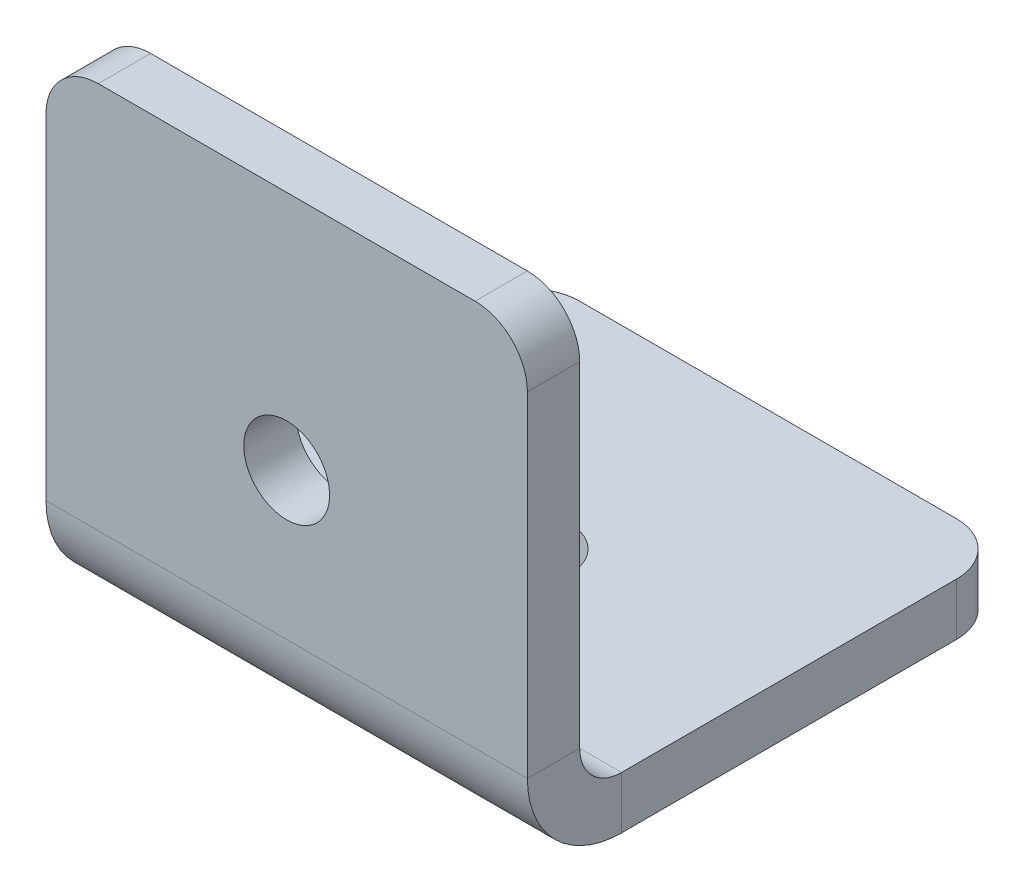
ISO-10303-21;
HEADER;
FILE_DESCRIPTION(('STEP AP214'),'2;1');
FILE_NAME('part.step','',(''),(''),'','','');
FILE_SCHEMA(('AUTOMOTIVE_DESIGN { 1 0 10303 214 1 1 1 1 }'));
ENDSEC;
DATA;
#1=APPLICATION_CONTEXT('core data for automotive mechanical design processes');
#2=APPLICATION_PROTOCOL_DEFINITION('international standard','automotive_design',2000,#1);
#3=PRODUCT_CONTEXT('',#1,'mechanical');
#4=PRODUCT('Part','Part','',(#3));
#5=PRODUCT_RELATED_PRODUCT_CATEGORY('part','',(#4));
#6=PRODUCT_DEFINITION_FORMATION('','',#4);
#7=PRODUCT_DEFINITION_CONTEXT('part definition',#1,'design');
#8=PRODUCT_DEFINITION('design','',#6,#7);
#9=PRODUCT_DEFINITION_SHAPE('','',#8);
#10=(LENGTH_UNIT() NAMED_UNIT(*) SI_UNIT(.MILLI.,.METRE.));
#11=(NAMED_UNIT(*) PLANE_ANGLE_UNIT() SI_UNIT($,.RADIAN.));
#12=(NAMED_UNIT(*) SI_UNIT($,.STERADIAN.) SOLID_ANGLE_UNIT());
#13=UNCERTAINTY_MEASURE_WITH_UNIT(LENGTH_MEASURE(1.E-05),#10,'distance_accuracy_value','');
#14=(GEOMETRIC_REPRESENTATION_CONTEXT(3) GLOBAL_UNCERTAINTY_ASSIGNED_CONTEXT((#13)) GLOBAL_UNIT_ASSIGNED_CONTEXT((#10,
#11,#12)) REPRESENTATION_CONTEXT('',''));
#15=CARTESIAN_POINT('',(0.,0.,0.));
#16=DIRECTION('',(0.,0.,1.));
#17=DIRECTION('',(1.,0.,0.));
#18=AXIS2_PLACEMENT_3D('',#15,#16,#17);
#19=CARTESIAN_POINT('',(23.,9.,0.));
#20=DIRECTION('',(1.,0.,0.));
#21=DIRECTION('',(0.,0.,-1.));
#22=AXIS2_PLACEMENT_3D('',#19,#20,#21);
#23=PLANE('',#22);
#24=DIRECTION('',(0.,0.,-1.));
#25=VECTOR('',#24,1.);
#26=CARTESIAN_POINT('',(23.,9.,0.));
#27=LINE('',#26,#25);
#28=CARTESIAN_POINT('',(23.,9.,0.));
#29=VERTEX_POINT('',#28);
#30=CARTESIAN_POINT('',(23.,9.,-5.));
#31=VERTEX_POINT('',#30);
#32=EDGE_CURVE('E115',#29,#31,#27,.T.);
#33=ORIENTED_EDGE('',*,*,#32,.F.);
#34=CARTESIAN_POINT('',(23.,9.,-9.));
#35=DIRECTION('',(-1.,0.,0.));
#36=DIRECTION('',(0.,0.,1.));
#37=AXIS2_PLACEMENT_3D('',#34,#35,#36);
#38=CIRCLE('',#37,9.);
#39=CARTESIAN_POINT('',(23.,0.,-9.));
#40=VERTEX_POINT('',#39);
#41=EDGE_CURVE('E113',#29,#40,#38,.F.);
#42=ORIENTED_EDGE('',*,*,#41,.T.);
#43=DIRECTION('',(0.,-1.,0.));
#44=VECTOR('',#43,1.);
#45=CARTESIAN_POINT('',(23.,5.,-9.));
#46=LINE('',#45,#44);
#47=CARTESIAN_POINT('',(23.,5.,-9.));
#48=VERTEX_POINT('',#47);
#49=EDGE_CURVE('E107',#48,#40,#46,.T.);
#50=ORIENTED_EDGE('',*,*,#49,.F.);
#51=CARTESIAN_POINT('',(23.,9.,-9.));
#52=DIRECTION('',(1.,0.,0.));
#53=DIRECTION('',(0.,0.,-1.));
#54=AXIS2_PLACEMENT_3D('',#51,#52,#53);
#55=CIRCLE('',#54,4.);
#56=EDGE_CURVE('E111',#31,#48,#55,.T.);
#57=ORIENTED_EDGE('',*,*,#56,.F.);
#58=EDGE_LOOP('',(#33,#42,#50,#57));
#59=FACE_BOUND('',#58,.T.);
#60=ADVANCED_FACE('F16',(#59),#23,.T.);
#61=CARTESIAN_POINT('',(23.,5.,-9.));
#62=DIRECTION('',(1.,0.,0.));
#63=DIRECTION('',(0.,0.,-1.));
#64=AXIS2_PLACEMENT_3D('',#61,#62,#63);
#65=PLANE('',#64);
#66=DIRECTION('',(0.,1.,0.));
#67=VECTOR('',#66,1.);
#68=CARTESIAN_POINT('',(23.,0.,-5.));
#69=LINE('',#68,#67);
#70=CARTESIAN_POINT('',(23.,41.,-5.));
#71=VERTEX_POINT('',#70);
#72=EDGE_CURVE('E139',#71,#31,#69,.F.);
#73=ORIENTED_EDGE('',*,*,#72,.F.);
#74=DIRECTION('',(0.,0.,-1.));
#75=VECTOR('',#74,1.);
#76=CARTESIAN_POINT('',(23.,41.,-9.));
#77=LINE('',#76,#75);
#78=CARTESIAN_POINT('',(23.,41.,0.));
#79=VERTEX_POINT('',#78);
#80=EDGE_CURVE('E192',#71,#79,#77,.F.);
#81=ORIENTED_EDGE('',*,*,#80,.T.);
#82=DIRECTION('',(0.,-1.,0.));
#83=VECTOR('',#82,1.);
#84=CARTESIAN_POINT('',(23.,0.,0.));
#85=LINE('',#84,#83);
#86=EDGE_CURVE('E141',#79,#29,#85,.T.);
#87=ORIENTED_EDGE('',*,*,#86,.T.);
#88=ORIENTED_EDGE('',*,*,#32,.T.);
#89=EDGE_LOOP('',(#73,#81,#87,#88));
#90=FACE_BOUND('',#89,.T.);
#91=ADVANCED_FACE('F254',(#90),#65,.T.);
#92=CARTESIAN_POINT('',(-23.,0.,-9.));
#93=DIRECTION('',(-1.,0.,0.));
#94=DIRECTION('',(0.,0.,1.));
#95=AXIS2_PLACEMENT_3D('',#92,#93,#94);
#96=PLANE('',#95);
#97=DIRECTION('',(0.,1.,0.));
#98=VECTOR('',#97,1.);
#99=CARTESIAN_POINT('',(-23.,0.,-9.));
#100=LINE('',#99,#98);
#101=CARTESIAN_POINT('',(-23.,0.,-9.));
#102=VERTEX_POINT('',#101);
#103=CARTESIAN_POINT('',(-23.,5.,-9.));
#104=VERTEX_POINT('',#103);
#105=EDGE_CURVE('E116',#102,#104,#100,.T.);
#106=ORIENTED_EDGE('',*,*,#105,.F.);
#107=CARTESIAN_POINT('',(-23.,9.,-9.));
#108=DIRECTION('',(-1.,0.,0.));
#109=DIRECTION('',(0.,0.,1.));
#110=AXIS2_PLACEMENT_3D('',#107,#108,#109);
#111=CIRCLE('',#110,9.);
#112=CARTESIAN_POINT('',(-23.,9.,0.));
#113=VERTEX_POINT('',#112);
#114=EDGE_CURVE('E159',#113,#102,#111,.F.);
#115=ORIENTED_EDGE('',*,*,#114,.F.);
#116=DIRECTION('',(0.,0.,1.));
#117=VECTOR('',#116,1.);
#118=CARTESIAN_POINT('',(-23.,9.,-5.));
#119=LINE('',#118,#117);
#120=CARTESIAN_POINT('',(-23.,9.,-5.));
#121=VERTEX_POINT('',#120);
#122=EDGE_CURVE('E177',#121,#113,#119,.T.);
#123=ORIENTED_EDGE('',*,*,#122,.F.);
#124=CARTESIAN_POINT('',(-23.,9.,-9.));
#125=DIRECTION('',(1.,0.,0.));
#126=DIRECTION('',(0.,0.,-1.));
#127=AXIS2_PLACEMENT_3D('',#124,#125,#126);
#128=CIRCLE('',#127,4.);
#129=EDGE_CURVE('E153',#121,#104,#128,.T.);
#130=ORIENTED_EDGE('',*,*,#129,.T.);
#131=EDGE_LOOP('',(#106,#115,#123,#130));
#132=FACE_BOUND('',#131,.T.);
#133=ADVANCED_FACE('F259',(#132),#96,.T.);
#134=CARTESIAN_POINT('',(-23.,9.,-5.));
#135=DIRECTION('',(-1.,0.,0.));
#136=DIRECTION('',(0.,0.,1.));
#137=AXIS2_PLACEMENT_3D('',#134,#135,#136);
#138=PLANE('',#137);
#139=DIRECTION('',(0.,0.,-1.));
#140=VECTOR('',#139,1.);
#141=CARTESIAN_POINT('',(-23.,5.,0.));
#142=LINE('',#141,#140);
#143=CARTESIAN_POINT('',(-23.,5.,-41.));
#144=VERTEX_POINT('',#143);
#145=EDGE_CURVE('E126',#104,#144,#142,.T.);
#146=ORIENTED_EDGE('',*,*,#145,.T.);
#147=DIRECTION('',(0.,-1.,0.));
#148=VECTOR('',#147,1.);
#149=CARTESIAN_POINT('',(-23.,9.,-41.));
#150=LINE('',#149,#148);
#151=CARTESIAN_POINT('',(-23.,0.,-41.));
#152=VERTEX_POINT('',#151);
#153=EDGE_CURVE('E201',#144,#152,#150,.T.);
#154=ORIENTED_EDGE('',*,*,#153,.T.);
#155=DIRECTION('',(0.,0.,-1.));
#156=VECTOR('',#155,1.);
#157=CARTESIAN_POINT('',(-23.,0.,0.));
#158=LINE('',#157,#156);
#159=EDGE_CURVE('E148',#102,#152,#158,.T.);
#160=ORIENTED_EDGE('',*,*,#159,.F.);
#161=ORIENTED_EDGE('',*,*,#105,.T.);
#162=EDGE_LOOP('',(#146,#154,#160,#161));
#163=FACE_BOUND('',#162,.T.);
#164=ADVANCED_FACE('F217',(#163),#138,.T.);
#165=CARTESIAN_POINT('',(23.,0.,0.));
#166=DIRECTION('',(0.,1.,0.));
#167=DIRECTION('',(0.,0.,1.));
#168=AXIS2_PLACEMENT_3D('',#165,#166,#167);
#169=PLANE('',#168);
#170=CARTESIAN_POINT('',(0.,0.,-23.));
#171=DIRECTION('',(0.,1.,0.));
#172=DIRECTION('',(0.,0.,1.));
#173=AXIS2_PLACEMENT_3D('',#170,#171,#172);
#174=CIRCLE('',#173,4.1);
#175=CARTESIAN_POINT('',(0.,0.,-18.9));
#176=VERTEX_POINT('',#175);
#177=EDGE_CURVE('E231',#176,#176,#174,.T.);
#178=ORIENTED_EDGE('',*,*,#177,.T.);
#179=EDGE_LOOP('',(#178));
#180=FACE_BOUND('',#179,.T.);
#181=ORIENTED_EDGE('',*,*,#159,.T.);
#182=CARTESIAN_POINT('',(-18.,0.,-41.));
#183=DIRECTION('',(0.,1.,0.));
#184=DIRECTION('',(0.,0.,1.));
#185=AXIS2_PLACEMENT_3D('',#182,#183,#184);
#186=CIRCLE('',#185,5.);
#187=CARTESIAN_POINT('',(-18.,0.,-46.));
#188=VERTEX_POINT('',#187);
#189=EDGE_CURVE('E206',#152,#188,#186,.F.);
#190=ORIENTED_EDGE('',*,*,#189,.T.);
#191=DIRECTION('',(-1.,0.,0.));
#192=VECTOR('',#191,1.);
#193=CARTESIAN_POINT('',(23.,0.,-46.));
#194=LINE('',#193,#192);
#195=CARTESIAN_POINT('',(18.,0.,-46.));
#196=VERTEX_POINT('',#195);
#197=EDGE_CURVE('E175',#196,#188,#194,.T.);
#198=ORIENTED_EDGE('',*,*,#197,.F.);
#199=CARTESIAN_POINT('',(18.,0.,-41.));
#200=DIRECTION('',(0.,1.,0.));
#201=DIRECTION('',(0.,0.,1.));
#202=AXIS2_PLACEMENT_3D('',#199,#200,#201);
#203=CIRCLE('',#202,5.);
#204=CARTESIAN_POINT('',(23.,0.,-41.));
#205=VERTEX_POINT('',#204);
#206=EDGE_CURVE('E204',#196,#205,#203,.F.);
#207=ORIENTED_EDGE('',*,*,#206,.T.);
#208=DIRECTION('',(0.,0.,-1.));
#209=VECTOR('',#208,1.);
#210=CARTESIAN_POINT('',(23.,0.,0.));
#211=LINE('',#210,#209);
#212=EDGE_CURVE('E134',#40,#205,#211,.T.);
#213=ORIENTED_EDGE('',*,*,#212,.F.);
#214=DIRECTION('',(-1.,0.,0.));
#215=VECTOR('',#214,1.);
#216=CARTESIAN_POINT('',(23.,0.,-9.));
#217=LINE('',#216,#215);
#218=EDGE_CURVE('E147',#40,#102,#217,.T.);
#219=ORIENTED_EDGE('',*,*,#218,.T.);
#220=EDGE_LOOP('',(#181,#190,#198,#207,#213,#219));
#221=FACE_BOUND('',#220,.T.);
#222=ADVANCED_FACE('F222',(#180,#221),#169,.F.);
#223=CARTESIAN_POINT('',(23.,5.,-46.));
#224=DIRECTION('',(0.,0.,-1.));
#225=DIRECTION('',(-1.,0.,0.));
#226=AXIS2_PLACEMENT_3D('',#223,#224,#225);
#227=PLANE('',#226);
#228=ORIENTED_EDGE('',*,*,#197,.T.);
#229=DIRECTION('',(0.,-1.,0.));
#230=VECTOR('',#229,1.);
#231=CARTESIAN_POINT('',(-18.,5.,-46.));
#232=LINE('',#231,#230);
#233=CARTESIAN_POINT('',(-18.,5.,-46.));
#234=VERTEX_POINT('',#233);
#235=EDGE_CURVE('E37',#188,#234,#232,.F.);
#236=ORIENTED_EDGE('',*,*,#235,.T.);
#237=DIRECTION('',(-1.,0.,0.));
#238=VECTOR('',#237,1.);
#239=CARTESIAN_POINT('',(23.,5.,-46.));
#240=LINE('',#239,#238);
#241=CARTESIAN_POINT('',(18.,5.,-46.));
#242=VERTEX_POINT('',#241);
#243=EDGE_CURVE('E130',#242,#234,#240,.T.);
#244=ORIENTED_EDGE('',*,*,#243,.F.);
#245=DIRECTION('',(0.,-1.,0.));
#246=VECTOR('',#245,1.);
#247=CARTESIAN_POINT('',(18.,5.,-46.));
#248=LINE('',#247,#246);
#249=EDGE_CURVE('E208',#242,#196,#248,.T.);
#250=ORIENTED_EDGE('',*,*,#249,.T.);
#251=EDGE_LOOP('',(#228,#236,#244,#250));
#252=FACE_BOUND('',#251,.T.);
#253=ADVANCED_FACE('F223',(#252),#227,.T.);
#254=CARTESIAN_POINT('',(23.,5.,0.));
#255=DIRECTION('',(0.,1.,0.));
#256=DIRECTION('',(0.,0.,1.));
#257=AXIS2_PLACEMENT_3D('',#254,#255,#256);
#258=PLANE('',#257);
#259=CARTESIAN_POINT('',(0.,5.,-23.));
#260=DIRECTION('',(0.,1.,0.));
#261=DIRECTION('',(0.,0.,1.));
#262=AXIS2_PLACEMENT_3D('',#259,#260,#261);
#263=CIRCLE('',#262,4.1);
#264=CARTESIAN_POINT('',(0.,5.,-18.9));
#265=VERTEX_POINT('',#264);
#266=EDGE_CURVE('E236',#265,#265,#263,.T.);
#267=ORIENTED_EDGE('',*,*,#266,.F.);
#268=EDGE_LOOP('',(#267));
#269=FACE_BOUND('',#268,.T.);
#270=ORIENTED_EDGE('',*,*,#243,.T.);
#271=CARTESIAN_POINT('',(-18.,5.,-41.));
#272=DIRECTION('',(0.,1.,0.));
#273=DIRECTION('',(0.,0.,1.));
#274=AXIS2_PLACEMENT_3D('',#271,#272,#273);
#275=CIRCLE('',#274,5.);
#276=EDGE_CURVE('E24',#234,#144,#275,.T.);
#277=ORIENTED_EDGE('',*,*,#276,.T.);
#278=ORIENTED_EDGE('',*,*,#145,.F.);
#279=DIRECTION('',(-1.,0.,0.));
#280=VECTOR('',#279,1.);
#281=CARTESIAN_POINT('',(23.,5.,-9.));
#282=LINE('',#281,#280);
#283=EDGE_CURVE('E121',#48,#104,#282,.T.);
#284=ORIENTED_EDGE('',*,*,#283,.F.);
#285=DIRECTION('',(0.,0.,-1.));
#286=VECTOR('',#285,1.);
#287=CARTESIAN_POINT('',(23.,5.,0.));
#288=LINE('',#287,#286);
#289=CARTESIAN_POINT('',(23.,5.,-41.));
#290=VERTEX_POINT('',#289);
#291=EDGE_CURVE('E123',#48,#290,#288,.T.);
#292=ORIENTED_EDGE('',*,*,#291,.T.);
#293=CARTESIAN_POINT('',(18.,5.,-41.));
#294=DIRECTION('',(0.,1.,0.));
#295=DIRECTION('',(0.,0.,1.));
#296=AXIS2_PLACEMENT_3D('',#293,#294,#295);
#297=CIRCLE('',#296,5.);
#298=EDGE_CURVE('E212',#290,#242,#297,.T.);
#299=ORIENTED_EDGE('',*,*,#298,.T.);
#300=EDGE_LOOP('',(#270,#277,#278,#284,#292,#299));
#301=FACE_BOUND('',#300,.T.);
#302=ADVANCED_FACE('F122',(#269,#301),#258,.T.);
#303=CARTESIAN_POINT('',(23.,9.,-9.));
#304=DIRECTION('',(-1.,0.,0.));
#305=DIRECTION('',(0.,0.,1.));
#306=AXIS2_PLACEMENT_3D('',#303,#304,#305);
#307=CYLINDRICAL_SURFACE('',#306,4.);
#308=ORIENTED_EDGE('',*,*,#129,.F.);
#309=DIRECTION('',(-1.,0.,0.));
#310=VECTOR('',#309,1.);
#311=CARTESIAN_POINT('',(23.,9.,-5.));
#312=LINE('',#311,#310);
#313=EDGE_CURVE('E131',#31,#121,#312,.T.);
#314=ORIENTED_EDGE('',*,*,#313,.F.);
#315=ORIENTED_EDGE('',*,*,#56,.T.);
#316=ORIENTED_EDGE('',*,*,#283,.T.);
#317=EDGE_LOOP('',(#308,#314,#315,#316));
#318=FACE_BOUND('',#317,.T.);
#319=ADVANCED_FACE('F137',(#318),#307,.F.);
#320=CARTESIAN_POINT('',(23.,0.,-5.));
#321=DIRECTION('',(0.,0.,-1.));
#322=DIRECTION('',(-1.,0.,0.));
#323=AXIS2_PLACEMENT_3D('',#320,#321,#322);
#324=PLANE('',#323);
#325=CARTESIAN_POINT('',(0.,23.,-5.));
#326=DIRECTION('',(0.,0.,-1.));
#327=DIRECTION('',(-1.,0.,0.));
#328=AXIS2_PLACEMENT_3D('',#325,#326,#327);
#329=CIRCLE('',#328,4.1);
#330=CARTESIAN_POINT('',(-4.1,23.,-5.));
#331=VERTEX_POINT('',#330);
#332=EDGE_CURVE('E228',#331,#331,#329,.T.);
#333=ORIENTED_EDGE('',*,*,#332,.F.);
#334=EDGE_LOOP('',(#333));
#335=FACE_BOUND('',#334,.T.);
#336=DIRECTION('',(-1.,0.,0.));
#337=VECTOR('',#336,1.);
#338=CARTESIAN_POINT('',(23.,46.,-5.));
#339=LINE('',#338,#337);
#340=CARTESIAN_POINT('',(18.,46.,-5.));
#341=VERTEX_POINT('',#340);
#342=CARTESIAN_POINT('',(-18.,46.,-5.));
#343=VERTEX_POINT('',#342);
#344=EDGE_CURVE('E170',#341,#343,#339,.T.);
#345=ORIENTED_EDGE('',*,*,#344,.F.);
#346=CARTESIAN_POINT('',(18.,41.,-5.));
#347=DIRECTION('',(0.,0.,-1.));
#348=DIRECTION('',(-1.,0.,0.));
#349=AXIS2_PLACEMENT_3D('',#346,#347,#348);
#350=CIRCLE('',#349,5.);
#351=EDGE_CURVE('E190',#341,#71,#350,.T.);
#352=ORIENTED_EDGE('',*,*,#351,.T.);
#353=ORIENTED_EDGE('',*,*,#72,.T.);
#354=ORIENTED_EDGE('',*,*,#313,.T.);
#355=DIRECTION('',(0.,1.,0.));
#356=VECTOR('',#355,1.);
#357=CARTESIAN_POINT('',(-23.,0.,-5.));
#358=LINE('',#357,#356);
#359=CARTESIAN_POINT('',(-23.,41.,-5.));
#360=VERTEX_POINT('',#359);
#361=EDGE_CURVE('E155',#360,#121,#358,.F.);
#362=ORIENTED_EDGE('',*,*,#361,.F.);
#363=CARTESIAN_POINT('',(-18.,41.,-5.));
#364=DIRECTION('',(0.,0.,-1.));
#365=DIRECTION('',(-1.,0.,0.));
#366=AXIS2_PLACEMENT_3D('',#363,#364,#365);
#367=CIRCLE('',#366,5.);
#368=EDGE_CURVE('E188',#360,#343,#367,.T.);
#369=ORIENTED_EDGE('',*,*,#368,.T.);
#370=EDGE_LOOP('',(#345,#352,#353,#354,#362,#369));
#371=FACE_BOUND('',#370,.T.);
#372=ADVANCED_FACE('F250',(#335,#371),#324,.T.);
#373=CARTESIAN_POINT('',(23.,46.,0.));
#374=DIRECTION('',(0.,1.,0.));
#375=DIRECTION('',(0.,0.,1.));
#376=AXIS2_PLACEMENT_3D('',#373,#374,#375);
#377=PLANE('',#376);
#378=DIRECTION('',(-1.,0.,0.));
#379=VECTOR('',#378,1.);
#380=CARTESIAN_POINT('',(23.,46.,0.));
#381=LINE('',#380,#379);
#382=CARTESIAN_POINT('',(18.,46.,0.));
#383=VERTEX_POINT('',#382);
#384=CARTESIAN_POINT('',(-18.,46.,0.));
#385=VERTEX_POINT('',#384);
#386=EDGE_CURVE('E167',#383,#385,#381,.T.);
#387=ORIENTED_EDGE('',*,*,#386,.F.);
#388=DIRECTION('',(0.,0.,-1.));
#389=VECTOR('',#388,1.);
#390=CARTESIAN_POINT('',(18.,46.,0.));
#391=LINE('',#390,#389);
#392=EDGE_CURVE('E185',#383,#341,#391,.T.);
#393=ORIENTED_EDGE('',*,*,#392,.T.);
#394=ORIENTED_EDGE('',*,*,#344,.T.);
#395=DIRECTION('',(0.,0.,-1.));
#396=VECTOR('',#395,1.);
#397=CARTESIAN_POINT('',(-18.,46.,0.));
#398=LINE('',#397,#396);
#399=EDGE_CURVE('E183',#343,#385,#398,.F.);
#400=ORIENTED_EDGE('',*,*,#399,.T.);
#401=EDGE_LOOP('',(#387,#393,#394,#400));
#402=FACE_BOUND('',#401,.T.);
#403=ADVANCED_FACE('F357',(#402),#377,.T.);
#404=CARTESIAN_POINT('',(23.,0.,0.));
#405=DIRECTION('',(0.,0.,-1.));
#406=DIRECTION('',(-1.,0.,0.));
#407=AXIS2_PLACEMENT_3D('',#404,#405,#406);
#408=PLANE('',#407);
#409=CARTESIAN_POINT('',(0.,23.,0.));
#410=DIRECTION('',(0.,0.,-1.));
#411=DIRECTION('',(-1.,0.,0.));
#412=AXIS2_PLACEMENT_3D('',#409,#410,#411);
#413=CIRCLE('',#412,4.1);
#414=CARTESIAN_POINT('',(-4.1,23.,0.));
#415=VERTEX_POINT('',#414);
#416=EDGE_CURVE('E151',#415,#415,#413,.T.);
#417=ORIENTED_EDGE('',*,*,#416,.T.);
#418=EDGE_LOOP('',(#417));
#419=FACE_BOUND('',#418,.T.);
#420=ORIENTED_EDGE('',*,*,#86,.F.);
#421=CARTESIAN_POINT('',(18.,41.,0.));
#422=DIRECTION('',(0.,0.,-1.));
#423=DIRECTION('',(-1.,0.,0.));
#424=AXIS2_PLACEMENT_3D('',#421,#422,#423);
#425=CIRCLE('',#424,5.);
#426=EDGE_CURVE('E196',#79,#383,#425,.F.);
#427=ORIENTED_EDGE('',*,*,#426,.T.);
#428=ORIENTED_EDGE('',*,*,#386,.T.);
#429=CARTESIAN_POINT('',(-18.,41.,0.));
#430=DIRECTION('',(0.,0.,-1.));
#431=DIRECTION('',(-1.,0.,0.));
#432=AXIS2_PLACEMENT_3D('',#429,#430,#431);
#433=CIRCLE('',#432,5.);
#434=CARTESIAN_POINT('',(-23.,41.,0.));
#435=VERTEX_POINT('',#434);
#436=EDGE_CURVE('E194',#385,#435,#433,.F.);
#437=ORIENTED_EDGE('',*,*,#436,.T.);
#438=DIRECTION('',(0.,-1.,0.));
#439=VECTOR('',#438,1.);
#440=CARTESIAN_POINT('',(-23.,0.,0.));
#441=LINE('',#440,#439);
#442=EDGE_CURVE('E157',#435,#113,#441,.T.);
#443=ORIENTED_EDGE('',*,*,#442,.T.);
#444=DIRECTION('',(-1.,0.,0.));
#445=VECTOR('',#444,1.);
#446=CARTESIAN_POINT('',(23.,9.,0.));
#447=LINE('',#446,#445);
#448=EDGE_CURVE('E164',#29,#113,#447,.T.);
#449=ORIENTED_EDGE('',*,*,#448,.F.);
#450=EDGE_LOOP('',(#420,#427,#428,#437,#443,#449));
#451=FACE_BOUND('',#450,.T.);
#452=ADVANCED_FACE('F347',(#419,#451),#408,.F.);
#453=CARTESIAN_POINT('',(23.,9.,-9.));
#454=DIRECTION('',(-1.,0.,0.));
#455=DIRECTION('',(0.,0.,1.));
#456=AXIS2_PLACEMENT_3D('',#453,#454,#455);
#457=CYLINDRICAL_SURFACE('',#456,9.);
#458=ORIENTED_EDGE('',*,*,#114,.T.);
#459=ORIENTED_EDGE('',*,*,#218,.F.);
#460=ORIENTED_EDGE('',*,*,#41,.F.);
#461=ORIENTED_EDGE('',*,*,#448,.T.);
#462=EDGE_LOOP('',(#458,#459,#460,#461));
#463=FACE_BOUND('',#462,.T.);
#464=ADVANCED_FACE('F339',(#463),#457,.T.);
#465=CARTESIAN_POINT('',(23.,9.,-9.));
#466=DIRECTION('',(1.,0.,0.));
#467=DIRECTION('',(0.,0.,-1.));
#468=AXIS2_PLACEMENT_3D('',#465,#466,#467);
#469=PLANE('',#468);
#470=ORIENTED_EDGE('',*,*,#212,.T.);
#471=DIRECTION('',(0.,-1.,0.));
#472=VECTOR('',#471,1.);
#473=CARTESIAN_POINT('',(23.,9.,-41.));
#474=LINE('',#473,#472);
#475=EDGE_CURVE('E10',#205,#290,#474,.F.);
#476=ORIENTED_EDGE('',*,*,#475,.T.);
#477=ORIENTED_EDGE('',*,*,#291,.F.);
#478=ORIENTED_EDGE('',*,*,#49,.T.);
#479=EDGE_LOOP('',(#470,#476,#477,#478));
#480=FACE_BOUND('',#479,.T.);
#481=ADVANCED_FACE('F133',(#480),#469,.T.);
#482=CARTESIAN_POINT('',(-23.,9.,-9.));
#483=DIRECTION('',(1.,0.,0.));
#484=DIRECTION('',(0.,0.,-1.));
#485=AXIS2_PLACEMENT_3D('',#482,#483,#484);
#486=PLANE('',#485);
#487=ORIENTED_EDGE('',*,*,#442,.F.);
#488=DIRECTION('',(0.,0.,-1.));
#489=VECTOR('',#488,1.);
#490=CARTESIAN_POINT('',(-23.,41.,-5.));
#491=LINE('',#490,#489);
#492=EDGE_CURVE('E198',#435,#360,#491,.T.);
#493=ORIENTED_EDGE('',*,*,#492,.T.);
#494=ORIENTED_EDGE('',*,*,#361,.T.);
#495=ORIENTED_EDGE('',*,*,#122,.T.);
#496=EDGE_LOOP('',(#487,#493,#494,#495));
#497=FACE_BOUND('',#496,.T.);
#498=ADVANCED_FACE('F320',(#497),#486,.F.);
#499=CARTESIAN_POINT('',(0.,23.,0.));
#500=DIRECTION('',(0.,0.,-1.));
#501=DIRECTION('',(-1.,0.,0.));
#502=AXIS2_PLACEMENT_3D('',#499,#500,#501);
#503=CYLINDRICAL_SURFACE('',#502,4.1);
#504=ORIENTED_EDGE('',*,*,#416,.F.);
#505=EDGE_LOOP('',(#504));
#506=FACE_BOUND('',#505,.T.);
#507=ORIENTED_EDGE('',*,*,#332,.T.);
#508=EDGE_LOOP('',(#507));
#509=FACE_BOUND('',#508,.T.);
#510=ADVANCED_FACE('F310',(#506,#509),#503,.F.);
#511=CARTESIAN_POINT('',(0.,-5.,-23.));
#512=DIRECTION('',(0.,1.,0.));
#513=DIRECTION('',(0.,0.,1.));
#514=AXIS2_PLACEMENT_3D('',#511,#512,#513);
#515=CYLINDRICAL_SURFACE('',#514,4.1);
#516=ORIENTED_EDGE('',*,*,#266,.T.);
#517=EDGE_LOOP('',(#516));
#518=FACE_BOUND('',#517,.T.);
#519=ORIENTED_EDGE('',*,*,#177,.F.);
#520=EDGE_LOOP('',(#519));
#521=FACE_BOUND('',#520,.T.);
#522=ADVANCED_FACE('F240',(#518,#521),#515,.F.);
#523=CARTESIAN_POINT('',(18.,41.,0.));
#524=DIRECTION('',(0.,0.,-1.));
#525=DIRECTION('',(-1.,0.,0.));
#526=AXIS2_PLACEMENT_3D('',#523,#524,#525);
#527=CYLINDRICAL_SURFACE('',#526,5.);
#528=ORIENTED_EDGE('',*,*,#426,.F.);
#529=ORIENTED_EDGE('',*,*,#80,.F.);
#530=ORIENTED_EDGE('',*,*,#351,.F.);
#531=ORIENTED_EDGE('',*,*,#392,.F.);
#532=EDGE_LOOP('',(#528,#529,#530,#531));
#533=FACE_BOUND('',#532,.T.);
#534=ADVANCED_FACE('F264',(#533),#527,.T.);
#535=CARTESIAN_POINT('',(-18.,41.,-9.));
#536=DIRECTION('',(0.,0.,1.));
#537=DIRECTION('',(1.,0.,0.));
#538=AXIS2_PLACEMENT_3D('',#535,#536,#537);
#539=CYLINDRICAL_SURFACE('',#538,5.);
#540=ORIENTED_EDGE('',*,*,#436,.F.);
#541=ORIENTED_EDGE('',*,*,#399,.F.);
#542=ORIENTED_EDGE('',*,*,#368,.F.);
#543=ORIENTED_EDGE('',*,*,#492,.F.);
#544=EDGE_LOOP('',(#540,#541,#542,#543));
#545=FACE_BOUND('',#544,.T.);
#546=ADVANCED_FACE('F267',(#545),#539,.T.);
#547=CARTESIAN_POINT('',(-18.,9.,-41.));
#548=DIRECTION('',(0.,-1.,0.));
#549=DIRECTION('',(0.,0.,-1.));
#550=AXIS2_PLACEMENT_3D('',#547,#548,#549);
#551=CYLINDRICAL_SURFACE('',#550,5.);
#552=ORIENTED_EDGE('',*,*,#276,.F.);
#553=ORIENTED_EDGE('',*,*,#235,.F.);
#554=ORIENTED_EDGE('',*,*,#189,.F.);
#555=ORIENTED_EDGE('',*,*,#153,.F.);
#556=EDGE_LOOP('',(#552,#553,#554,#555));
#557=FACE_BOUND('',#556,.T.);
#558=ADVANCED_FACE('F219',(#557),#551,.T.);
#559=CARTESIAN_POINT('',(18.,5.,-41.));
#560=DIRECTION('',(0.,-1.,0.));
#561=DIRECTION('',(0.,0.,-1.));
#562=AXIS2_PLACEMENT_3D('',#559,#560,#561);
#563=CYLINDRICAL_SURFACE('',#562,5.);
#564=ORIENTED_EDGE('',*,*,#298,.F.);
#565=ORIENTED_EDGE('',*,*,#475,.F.);
#566=ORIENTED_EDGE('',*,*,#206,.F.);
#567=ORIENTED_EDGE('',*,*,#249,.F.);
#568=EDGE_LOOP('',(#564,#565,#566,#567));
#569=FACE_BOUND('',#568,.T.);
#570=ADVANCED_FACE('F18',(#569),#563,.T.);
#571=CLOSED_SHELL('',(#60,#91,#133,#164,#222,#253,#302,#319,#372,#403,#452,#464,#481,#498,#510,
#522,#534,#546,#558,#570));
#572=MANIFOLD_SOLID_BREP('B1',#571);
#573=ADVANCED_BREP_SHAPE_REPRESENTATION('',(#18,#572),#14);
#574=SHAPE_DEFINITION_REPRESENTATION(#9,#573);
ENDSEC;
END-ISO-10303-21;
